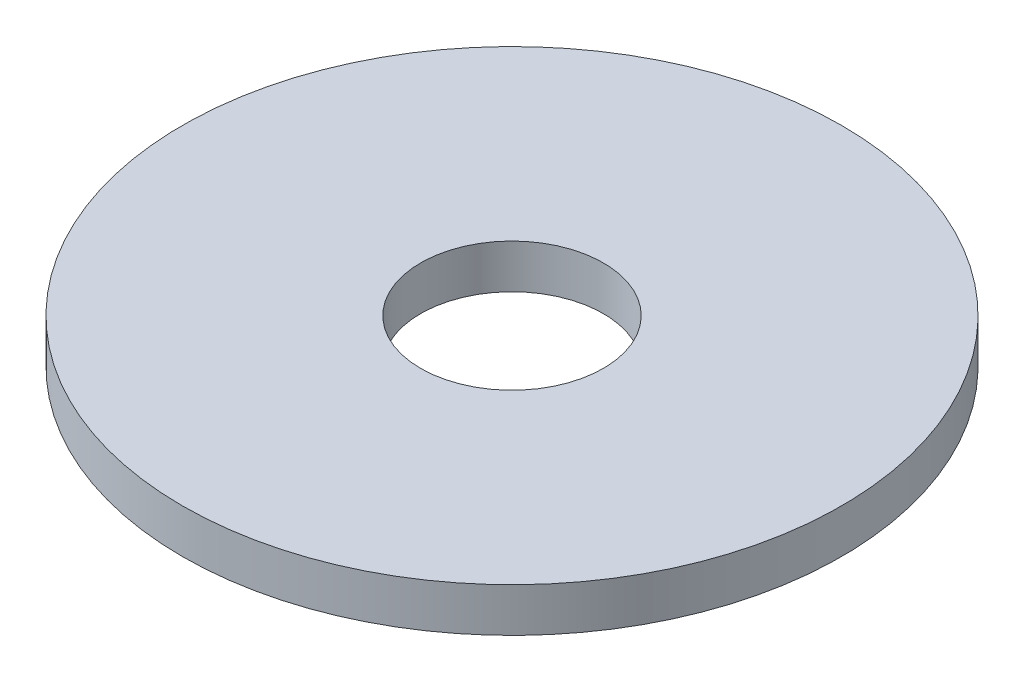
ISO-10303-21;
HEADER;
FILE_DESCRIPTION(('STEP AP214'),'2;1');
FILE_NAME('part.step','',(''),(''),'','','');
FILE_SCHEMA(('AUTOMOTIVE_DESIGN { 1 0 10303 214 1 1 1 1 }'));
ENDSEC;
DATA;
#1=APPLICATION_CONTEXT('core data for automotive mechanical design processes');
#2=APPLICATION_PROTOCOL_DEFINITION('international standard','automotive_design',2000,#1);
#3=PRODUCT_CONTEXT('',#1,'mechanical');
#4=PRODUCT('Part','Part','',(#3));
#5=PRODUCT_RELATED_PRODUCT_CATEGORY('part','',(#4));
#6=PRODUCT_DEFINITION_FORMATION('','',#4);
#7=PRODUCT_DEFINITION_CONTEXT('part definition',#1,'design');
#8=PRODUCT_DEFINITION('design','',#6,#7);
#9=PRODUCT_DEFINITION_SHAPE('','',#8);
#10=(LENGTH_UNIT() NAMED_UNIT(*) SI_UNIT(.MILLI.,.METRE.));
#11=(NAMED_UNIT(*) PLANE_ANGLE_UNIT() SI_UNIT($,.RADIAN.));
#12=(NAMED_UNIT(*) SI_UNIT($,.STERADIAN.) SOLID_ANGLE_UNIT());
#13=UNCERTAINTY_MEASURE_WITH_UNIT(LENGTH_MEASURE(1.E-05),#10,'distance_accuracy_value','');
#14=(GEOMETRIC_REPRESENTATION_CONTEXT(3) GLOBAL_UNCERTAINTY_ASSIGNED_CONTEXT((#13)) GLOBAL_UNIT_ASSIGNED_CONTEXT((#10,
#11,#12)) REPRESENTATION_CONTEXT('',''));
#15=CARTESIAN_POINT('',(0.,0.,0.));
#16=DIRECTION('',(0.,0.,1.));
#17=DIRECTION('',(1.,0.,0.));
#18=AXIS2_PLACEMENT_3D('',#15,#16,#17);
#19=CARTESIAN_POINT('',(0.,1.27,0.));
#20=DIRECTION('',(0.,1.,0.));
#21=DIRECTION('',(0.,0.,1.));
#22=AXIS2_PLACEMENT_3D('',#19,#20,#21);
#23=PLANE('',#22);
#24=CARTESIAN_POINT('',(0.,1.27,0.));
#25=DIRECTION('',(0.,1.,0.));
#26=DIRECTION('',(0.,0.,1.));
#27=AXIS2_PLACEMENT_3D('',#24,#25,#26);
#28=CIRCLE('',#27,9.525);
#29=CARTESIAN_POINT('',(0.,1.27,9.525));
#30=VERTEX_POINT('',#29);
#31=EDGE_CURVE('E10',#30,#30,#28,.T.);
#32=ORIENTED_EDGE('',*,*,#31,.T.);
#33=EDGE_LOOP('',(#32));
#34=FACE_BOUND('',#33,.T.);
#35=CARTESIAN_POINT('',(0.,1.27,0.));
#36=DIRECTION('',(0.,1.,0.));
#37=DIRECTION('',(0.,0.,1.));
#38=AXIS2_PLACEMENT_3D('',#35,#36,#37);
#39=CIRCLE('',#38,2.6416);
#40=CARTESIAN_POINT('',(0.,1.27,2.6416));
#41=VERTEX_POINT('',#40);
#42=EDGE_CURVE('E44',#41,#41,#39,.T.);
#43=ORIENTED_EDGE('',*,*,#42,.F.);
#44=EDGE_LOOP('',(#43));
#45=FACE_BOUND('',#44,.T.);
#46=ADVANCED_FACE('F33',(#34,#45),#23,.T.);
#47=CARTESIAN_POINT('',(0.,0.,0.));
#48=DIRECTION('',(0.,1.,0.));
#49=DIRECTION('',(0.,0.,1.));
#50=AXIS2_PLACEMENT_3D('',#47,#48,#49);
#51=PLANE('',#50);
#52=CARTESIAN_POINT('',(0.,0.,0.));
#53=DIRECTION('',(0.,1.,0.));
#54=DIRECTION('',(0.,0.,1.));
#55=AXIS2_PLACEMENT_3D('',#52,#53,#54);
#56=CIRCLE('',#55,9.525);
#57=CARTESIAN_POINT('',(0.,0.,9.525));
#58=VERTEX_POINT('',#57);
#59=EDGE_CURVE('E37',#58,#58,#56,.T.);
#60=ORIENTED_EDGE('',*,*,#59,.F.);
#61=EDGE_LOOP('',(#60));
#62=FACE_BOUND('',#61,.T.);
#63=CARTESIAN_POINT('',(0.,0.,0.));
#64=DIRECTION('',(0.,1.,0.));
#65=DIRECTION('',(0.,0.,1.));
#66=AXIS2_PLACEMENT_3D('',#63,#64,#65);
#67=CIRCLE('',#66,2.6416);
#68=CARTESIAN_POINT('',(0.,0.,2.6416));
#69=VERTEX_POINT('',#68);
#70=EDGE_CURVE('E46',#69,#69,#67,.T.);
#71=ORIENTED_EDGE('',*,*,#70,.T.);
#72=EDGE_LOOP('',(#71));
#73=FACE_BOUND('',#72,.T.);
#74=ADVANCED_FACE('F56',(#62,#73),#51,.F.);
#75=CARTESIAN_POINT('',(0.,1.27,0.));
#76=DIRECTION('',(0.,-1.,0.));
#77=DIRECTION('',(0.,0.,-1.));
#78=AXIS2_PLACEMENT_3D('',#75,#76,#77);
#79=CYLINDRICAL_SURFACE('',#78,9.525);
#80=ORIENTED_EDGE('',*,*,#31,.F.);
#81=EDGE_LOOP('',(#80));
#82=FACE_BOUND('',#81,.T.);
#83=ORIENTED_EDGE('',*,*,#59,.T.);
#84=EDGE_LOOP('',(#83));
#85=FACE_BOUND('',#84,.T.);
#86=ADVANCED_FACE('F35',(#82,#85),#79,.T.);
#87=CARTESIAN_POINT('',(0.,1.27,0.));
#88=DIRECTION('',(0.,-1.,0.));
#89=DIRECTION('',(0.,0.,-1.));
#90=AXIS2_PLACEMENT_3D('',#87,#88,#89);
#91=CYLINDRICAL_SURFACE('',#90,2.6416);
#92=ORIENTED_EDGE('',*,*,#42,.T.);
#93=EDGE_LOOP('',(#92));
#94=FACE_BOUND('',#93,.T.);
#95=ORIENTED_EDGE('',*,*,#70,.F.);
#96=EDGE_LOOP('',(#95));
#97=FACE_BOUND('',#96,.T.);
#98=ADVANCED_FACE('F52',(#94,#97),#91,.F.);
#99=CLOSED_SHELL('',(#46,#74,#86,#98));
#100=MANIFOLD_SOLID_BREP('B2',#99);
#101=ADVANCED_BREP_SHAPE_REPRESENTATION('',(#18,#100),#14);
#102=SHAPE_DEFINITION_REPRESENTATION(#9,#101);
ENDSEC;
END-ISO-10303-21;
